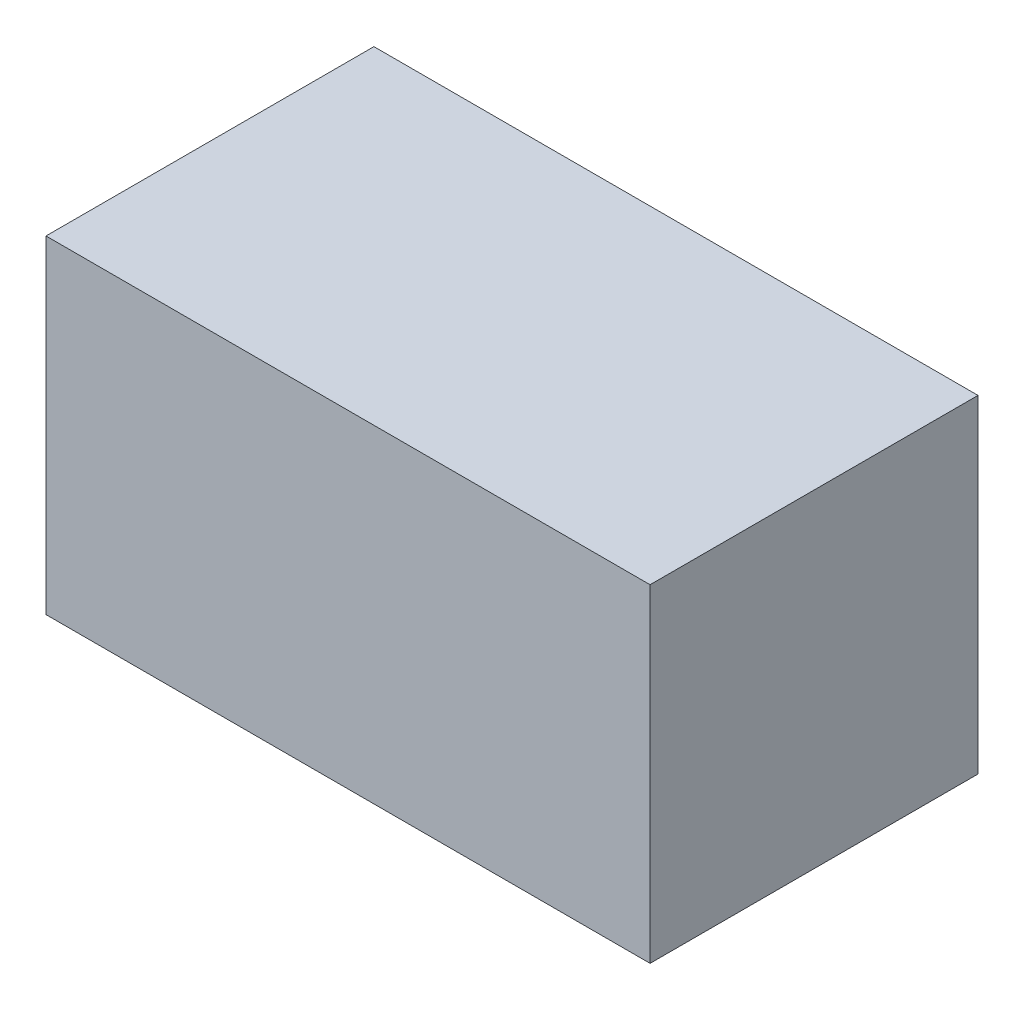
ISO-10303-21;
HEADER;
FILE_DESCRIPTION(('STEP AP214'),'2;1');
FILE_NAME('part.step','',(''),(''),'','','');
FILE_SCHEMA(('AUTOMOTIVE_DESIGN { 1 0 10303 214 1 1 1 1 }'));
ENDSEC;
DATA;
#1=APPLICATION_CONTEXT('core data for automotive mechanical design processes');
#2=APPLICATION_PROTOCOL_DEFINITION('international standard','automotive_design',2000,#1);
#3=PRODUCT_CONTEXT('',#1,'mechanical');
#4=PRODUCT('Part','Part','',(#3));
#5=PRODUCT_RELATED_PRODUCT_CATEGORY('part','',(#4));
#6=PRODUCT_DEFINITION_FORMATION('','',#4);
#7=PRODUCT_DEFINITION_CONTEXT('part definition',#1,'design');
#8=PRODUCT_DEFINITION('design','',#6,#7);
#9=PRODUCT_DEFINITION_SHAPE('','',#8);
#10=(LENGTH_UNIT() NAMED_UNIT(*) SI_UNIT(.MILLI.,.METRE.));
#11=(NAMED_UNIT(*) PLANE_ANGLE_UNIT() SI_UNIT($,.RADIAN.));
#12=(NAMED_UNIT(*) SI_UNIT($,.STERADIAN.) SOLID_ANGLE_UNIT());
#13=UNCERTAINTY_MEASURE_WITH_UNIT(LENGTH_MEASURE(1.E-05),#10,'distance_accuracy_value','');
#14=(GEOMETRIC_REPRESENTATION_CONTEXT(3) GLOBAL_UNCERTAINTY_ASSIGNED_CONTEXT((#13)) GLOBAL_UNIT_ASSIGNED_CONTEXT((#10,
#11,#12)) REPRESENTATION_CONTEXT('',''));
#15=CARTESIAN_POINT('',(0.,0.,0.));
#16=DIRECTION('',(0.,0.,1.));
#17=DIRECTION('',(1.,0.,0.));
#18=AXIS2_PLACEMENT_3D('',#15,#16,#17);
#19=CARTESIAN_POINT('',(0.87500206,-0.47500032,0.95));
#20=DIRECTION('',(0.,0.,-1.));
#21=DIRECTION('',(-1.,0.,0.));
#22=AXIS2_PLACEMENT_3D('',#19,#20,#21);
#23=PLANE('',#22);
#24=DIRECTION('',(1.,0.,0.));
#25=VECTOR('',#24,1.);
#26=CARTESIAN_POINT('',(0.87500206,0.47500032,0.95));
#27=LINE('',#26,#25);
#28=CARTESIAN_POINT('',(0.87500206,0.47500032,0.95));
#29=VERTEX_POINT('',#28);
#30=CARTESIAN_POINT('',(-0.87499952,0.47500032,0.95));
#31=VERTEX_POINT('',#30);
#32=EDGE_CURVE('E54',#29,#31,#27,.F.);
#33=ORIENTED_EDGE('',*,*,#32,.T.);
#34=DIRECTION('',(0.,1.,0.));
#35=VECTOR('',#34,1.);
#36=CARTESIAN_POINT('',(-0.87499952,0.47500032,0.95));
#37=LINE('',#36,#35);
#38=CARTESIAN_POINT('',(-0.87499952,-0.47500032,0.95));
#39=VERTEX_POINT('',#38);
#40=EDGE_CURVE('E57',#31,#39,#37,.F.);
#41=ORIENTED_EDGE('',*,*,#40,.T.);
#42=DIRECTION('',(1.,0.,0.));
#43=VECTOR('',#42,1.);
#44=CARTESIAN_POINT('',(-0.87499952,-0.47500032,0.95));
#45=LINE('',#44,#43);
#46=CARTESIAN_POINT('',(0.87500206,-0.47500032,0.95));
#47=VERTEX_POINT('',#46);
#48=EDGE_CURVE('E59',#39,#47,#45,.T.);
#49=ORIENTED_EDGE('',*,*,#48,.T.);
#50=DIRECTION('',(0.,1.,0.));
#51=VECTOR('',#50,1.);
#52=CARTESIAN_POINT('',(0.87500206,-0.47500032,0.95));
#53=LINE('',#52,#51);
#54=EDGE_CURVE('E19',#29,#47,#53,.F.);
#55=ORIENTED_EDGE('',*,*,#54,.F.);
#56=EDGE_LOOP('',(#33,#41,#49,#55));
#57=FACE_BOUND('',#56,.T.);
#58=ADVANCED_FACE('F16',(#57),#23,.F.);
#59=CARTESIAN_POINT('',(-0.87499952,-0.47500032,0.));
#60=DIRECTION('',(0.,1.,0.));
#61=DIRECTION('',(0.,0.,1.));
#62=AXIS2_PLACEMENT_3D('',#59,#60,#61);
#63=PLANE('',#62);
#64=DIRECTION('',(0.,0.,1.));
#65=VECTOR('',#64,1.);
#66=CARTESIAN_POINT('',(0.87500206,-0.47500032,0.));
#67=LINE('',#66,#65);
#68=CARTESIAN_POINT('',(0.87500206,-0.47500032,0.));
#69=VERTEX_POINT('',#68);
#70=EDGE_CURVE('E70',#69,#47,#67,.T.);
#71=ORIENTED_EDGE('',*,*,#70,.T.);
#72=ORIENTED_EDGE('',*,*,#48,.F.);
#73=DIRECTION('',(0.,0.,-1.));
#74=VECTOR('',#73,1.);
#75=CARTESIAN_POINT('',(-0.87499952,-0.47500032,0.));
#76=LINE('',#75,#74);
#77=CARTESIAN_POINT('',(-0.87499952,-0.47500032,0.));
#78=VERTEX_POINT('',#77);
#79=EDGE_CURVE('E64',#39,#78,#76,.T.);
#80=ORIENTED_EDGE('',*,*,#79,.T.);
#81=DIRECTION('',(-1.,0.,0.));
#82=VECTOR('',#81,1.);
#83=CARTESIAN_POINT('',(0.87500206,-0.47500032,0.));
#84=LINE('',#83,#82);
#85=EDGE_CURVE('E82',#69,#78,#84,.T.);
#86=ORIENTED_EDGE('',*,*,#85,.F.);
#87=EDGE_LOOP('',(#71,#72,#80,#86));
#88=FACE_BOUND('',#87,.T.);
#89=ADVANCED_FACE('F67',(#88),#63,.F.);
#90=CARTESIAN_POINT('',(-0.87499952,0.47500032,0.));
#91=DIRECTION('',(1.,0.,0.));
#92=DIRECTION('',(0.,0.,-1.));
#93=AXIS2_PLACEMENT_3D('',#90,#91,#92);
#94=PLANE('',#93);
#95=ORIENTED_EDGE('',*,*,#79,.F.);
#96=ORIENTED_EDGE('',*,*,#40,.F.);
#97=DIRECTION('',(0.,0.,-1.));
#98=VECTOR('',#97,1.);
#99=CARTESIAN_POINT('',(-0.87499952,0.47500032,0.));
#100=LINE('',#99,#98);
#101=CARTESIAN_POINT('',(-0.87499952,0.47500032,0.));
#102=VERTEX_POINT('',#101);
#103=EDGE_CURVE('E76',#31,#102,#100,.T.);
#104=ORIENTED_EDGE('',*,*,#103,.T.);
#105=DIRECTION('',(0.,1.,0.));
#106=VECTOR('',#105,1.);
#107=CARTESIAN_POINT('',(-0.87499952,-0.47500032,0.));
#108=LINE('',#107,#106);
#109=EDGE_CURVE('E73',#78,#102,#108,.T.);
#110=ORIENTED_EDGE('',*,*,#109,.F.);
#111=EDGE_LOOP('',(#95,#96,#104,#110));
#112=FACE_BOUND('',#111,.T.);
#113=ADVANCED_FACE('F71',(#112),#94,.F.);
#114=CARTESIAN_POINT('',(0.87500206,0.47500032,0.));
#115=DIRECTION('',(0.,-1.,0.));
#116=DIRECTION('',(0.,0.,-1.));
#117=AXIS2_PLACEMENT_3D('',#114,#115,#116);
#118=PLANE('',#117);
#119=ORIENTED_EDGE('',*,*,#103,.F.);
#120=ORIENTED_EDGE('',*,*,#32,.F.);
#121=DIRECTION('',(0.,0.,1.));
#122=VECTOR('',#121,1.);
#123=CARTESIAN_POINT('',(0.87500206,0.47500032,0.));
#124=LINE('',#123,#122);
#125=CARTESIAN_POINT('',(0.87500206,0.47500032,0.));
#126=VERTEX_POINT('',#125);
#127=EDGE_CURVE('E34',#29,#126,#124,.F.);
#128=ORIENTED_EDGE('',*,*,#127,.T.);
#129=DIRECTION('',(-1.,0.,0.));
#130=VECTOR('',#129,1.);
#131=CARTESIAN_POINT('',(0.87500206,0.47500032,0.));
#132=LINE('',#131,#130);
#133=EDGE_CURVE('E25',#102,#126,#132,.F.);
#134=ORIENTED_EDGE('',*,*,#133,.F.);
#135=EDGE_LOOP('',(#119,#120,#128,#134));
#136=FACE_BOUND('',#135,.T.);
#137=ADVANCED_FACE('F88',(#136),#118,.F.);
#138=CARTESIAN_POINT('',(0.87500206,-0.47500032,0.));
#139=DIRECTION('',(-1.,0.,0.));
#140=DIRECTION('',(0.,0.,1.));
#141=AXIS2_PLACEMENT_3D('',#138,#139,#140);
#142=PLANE('',#141);
#143=ORIENTED_EDGE('',*,*,#127,.F.);
#144=ORIENTED_EDGE('',*,*,#54,.T.);
#145=ORIENTED_EDGE('',*,*,#70,.F.);
#146=DIRECTION('',(0.,1.,0.));
#147=VECTOR('',#146,1.);
#148=CARTESIAN_POINT('',(0.87500206,-0.47500032,0.));
#149=LINE('',#148,#147);
#150=EDGE_CURVE('E11',#126,#69,#149,.F.);
#151=ORIENTED_EDGE('',*,*,#150,.F.);
#152=EDGE_LOOP('',(#143,#144,#145,#151));
#153=FACE_BOUND('',#152,.T.);
#154=ADVANCED_FACE('F90',(#153),#142,.F.);
#155=CARTESIAN_POINT('',(0.87500206,-0.47500032,0.));
#156=DIRECTION('',(0.,0.,-1.));
#157=DIRECTION('',(-1.,0.,0.));
#158=AXIS2_PLACEMENT_3D('',#155,#156,#157);
#159=PLANE('',#158);
#160=ORIENTED_EDGE('',*,*,#133,.T.);
#161=ORIENTED_EDGE('',*,*,#150,.T.);
#162=ORIENTED_EDGE('',*,*,#85,.T.);
#163=ORIENTED_EDGE('',*,*,#109,.T.);
#164=EDGE_LOOP('',(#160,#161,#162,#163));
#165=FACE_BOUND('',#164,.T.);
#166=ADVANCED_FACE('F87',(#165),#159,.T.);
#167=CLOSED_SHELL('',(#58,#89,#113,#137,#154,#166));
#168=MANIFOLD_SOLID_BREP('B1',#167);
#169=ADVANCED_BREP_SHAPE_REPRESENTATION('',(#18,#168),#14);
#170=SHAPE_DEFINITION_REPRESENTATION(#9,#169);
ENDSEC;
END-ISO-10303-21;
